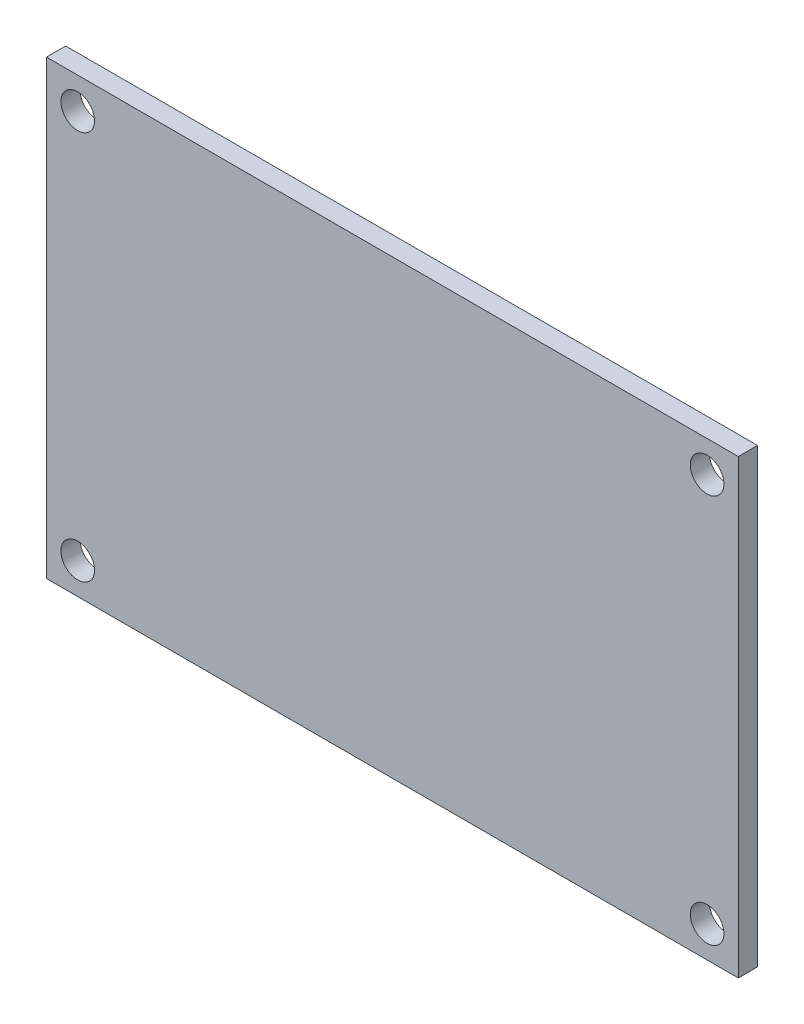
ISO-10303-21;
HEADER;
FILE_DESCRIPTION(('STEP AP214'),'2;1');
FILE_NAME('part.step','',(''),(''),'','','');
FILE_SCHEMA(('AUTOMOTIVE_DESIGN { 1 0 10303 214 1 1 1 1 }'));
ENDSEC;
DATA;
#1=APPLICATION_CONTEXT('core data for automotive mechanical design processes');
#2=APPLICATION_PROTOCOL_DEFINITION('international standard','automotive_design',2000,#1);
#3=PRODUCT_CONTEXT('',#1,'mechanical');
#4=PRODUCT('Part','Part','',(#3));
#5=PRODUCT_RELATED_PRODUCT_CATEGORY('part','',(#4));
#6=PRODUCT_DEFINITION_FORMATION('','',#4);
#7=PRODUCT_DEFINITION_CONTEXT('part definition',#1,'design');
#8=PRODUCT_DEFINITION('design','',#6,#7);
#9=PRODUCT_DEFINITION_SHAPE('','',#8);
#10=(LENGTH_UNIT() NAMED_UNIT(*) SI_UNIT(.MILLI.,.METRE.));
#11=(NAMED_UNIT(*) PLANE_ANGLE_UNIT() SI_UNIT($,.RADIAN.));
#12=(NAMED_UNIT(*) SI_UNIT($,.STERADIAN.) SOLID_ANGLE_UNIT());
#13=UNCERTAINTY_MEASURE_WITH_UNIT(LENGTH_MEASURE(1.E-05),#10,'distance_accuracy_value','');
#14=(GEOMETRIC_REPRESENTATION_CONTEXT(3) GLOBAL_UNCERTAINTY_ASSIGNED_CONTEXT((#13)) GLOBAL_UNIT_ASSIGNED_CONTEXT((#10,
#11,#12)) REPRESENTATION_CONTEXT('',''));
#15=CARTESIAN_POINT('',(0.,0.,0.));
#16=DIRECTION('',(0.,0.,1.));
#17=DIRECTION('',(1.,0.,0.));
#18=AXIS2_PLACEMENT_3D('',#15,#16,#17);
#19=CARTESIAN_POINT('',(36.,-23.5,2.));
#20=DIRECTION('',(-1.,0.,0.));
#21=DIRECTION('',(0.,0.,1.));
#22=AXIS2_PLACEMENT_3D('',#19,#20,#21);
#23=PLANE('',#22);
#24=DIRECTION('',(0.,1.,0.));
#25=VECTOR('',#24,1.);
#26=CARTESIAN_POINT('',(36.,-23.5,0.));
#27=LINE('',#26,#25);
#28=CARTESIAN_POINT('',(36.,-23.5,0.));
#29=VERTEX_POINT('',#28);
#30=CARTESIAN_POINT('',(36.,23.5,0.));
#31=VERTEX_POINT('',#30);
#32=EDGE_CURVE('E110',#29,#31,#27,.T.);
#33=ORIENTED_EDGE('',*,*,#32,.T.);
#34=DIRECTION('',(0.,0.,-1.));
#35=VECTOR('',#34,1.);
#36=CARTESIAN_POINT('',(36.,23.5,2.));
#37=LINE('',#36,#35);
#38=CARTESIAN_POINT('',(36.,23.5,2.));
#39=VERTEX_POINT('',#38);
#40=EDGE_CURVE('E11',#39,#31,#37,.T.);
#41=ORIENTED_EDGE('',*,*,#40,.F.);
#42=DIRECTION('',(0.,1.,0.));
#43=VECTOR('',#42,1.);
#44=CARTESIAN_POINT('',(36.,-23.5,2.));
#45=LINE('',#44,#43);
#46=CARTESIAN_POINT('',(36.,-23.5,2.));
#47=VERTEX_POINT('',#46);
#48=EDGE_CURVE('E93',#47,#39,#45,.T.);
#49=ORIENTED_EDGE('',*,*,#48,.F.);
#50=DIRECTION('',(0.,0.,-1.));
#51=VECTOR('',#50,1.);
#52=CARTESIAN_POINT('',(36.,-23.5,2.));
#53=LINE('',#52,#51);
#54=EDGE_CURVE('E106',#47,#29,#53,.T.);
#55=ORIENTED_EDGE('',*,*,#54,.T.);
#56=EDGE_LOOP('',(#33,#41,#49,#55));
#57=FACE_BOUND('',#56,.T.);
#58=ADVANCED_FACE('F39',(#57),#23,.F.);
#59=CARTESIAN_POINT('',(-36.,23.5,2.));
#60=DIRECTION('',(0.,-1.,0.));
#61=DIRECTION('',(0.,0.,-1.));
#62=AXIS2_PLACEMENT_3D('',#59,#60,#61);
#63=PLANE('',#62);
#64=DIRECTION('',(-1.,0.,0.));
#65=VECTOR('',#64,1.);
#66=CARTESIAN_POINT('',(-36.,23.5,0.));
#67=LINE('',#66,#65);
#68=CARTESIAN_POINT('',(-36.,23.5,0.));
#69=VERTEX_POINT('',#68);
#70=EDGE_CURVE('E98',#31,#69,#67,.T.);
#71=ORIENTED_EDGE('',*,*,#70,.T.);
#72=DIRECTION('',(0.,0.,-1.));
#73=VECTOR('',#72,1.);
#74=CARTESIAN_POINT('',(-36.,23.5,2.));
#75=LINE('',#74,#73);
#76=CARTESIAN_POINT('',(-36.,23.5,2.));
#77=VERTEX_POINT('',#76);
#78=EDGE_CURVE('E49',#77,#69,#75,.T.);
#79=ORIENTED_EDGE('',*,*,#78,.F.);
#80=DIRECTION('',(-1.,0.,0.));
#81=VECTOR('',#80,1.);
#82=CARTESIAN_POINT('',(-36.,23.5,2.));
#83=LINE('',#82,#81);
#84=EDGE_CURVE('E88',#39,#77,#83,.T.);
#85=ORIENTED_EDGE('',*,*,#84,.F.);
#86=ORIENTED_EDGE('',*,*,#40,.T.);
#87=EDGE_LOOP('',(#71,#79,#85,#86));
#88=FACE_BOUND('',#87,.T.);
#89=ADVANCED_FACE('F97',(#88),#63,.F.);
#90=CARTESIAN_POINT('',(-36.,-23.5,2.));
#91=DIRECTION('',(1.,0.,0.));
#92=DIRECTION('',(0.,0.,-1.));
#93=AXIS2_PLACEMENT_3D('',#90,#91,#92);
#94=PLANE('',#93);
#95=DIRECTION('',(0.,-1.,0.));
#96=VECTOR('',#95,1.);
#97=CARTESIAN_POINT('',(-36.,-23.5,0.));
#98=LINE('',#97,#96);
#99=CARTESIAN_POINT('',(-36.,-23.5,0.));
#100=VERTEX_POINT('',#99);
#101=EDGE_CURVE('E75',#69,#100,#98,.T.);
#102=ORIENTED_EDGE('',*,*,#101,.T.);
#103=DIRECTION('',(0.,0.,-1.));
#104=VECTOR('',#103,1.);
#105=CARTESIAN_POINT('',(-36.,-23.5,2.));
#106=LINE('',#105,#104);
#107=CARTESIAN_POINT('',(-36.,-23.5,2.));
#108=VERTEX_POINT('',#107);
#109=EDGE_CURVE('E100',#108,#100,#106,.T.);
#110=ORIENTED_EDGE('',*,*,#109,.F.);
#111=DIRECTION('',(0.,-1.,0.));
#112=VECTOR('',#111,1.);
#113=CARTESIAN_POINT('',(-36.,-23.5,2.));
#114=LINE('',#113,#112);
#115=EDGE_CURVE('E91',#77,#108,#114,.T.);
#116=ORIENTED_EDGE('',*,*,#115,.F.);
#117=ORIENTED_EDGE('',*,*,#78,.T.);
#118=EDGE_LOOP('',(#102,#110,#116,#117));
#119=FACE_BOUND('',#118,.T.);
#120=ADVANCED_FACE('F102',(#119),#94,.F.);
#121=CARTESIAN_POINT('',(-36.,-23.5,2.));
#122=DIRECTION('',(0.,1.,0.));
#123=DIRECTION('',(0.,0.,1.));
#124=AXIS2_PLACEMENT_3D('',#121,#122,#123);
#125=PLANE('',#124);
#126=DIRECTION('',(1.,0.,0.));
#127=VECTOR('',#126,1.);
#128=CARTESIAN_POINT('',(-36.,-23.5,0.));
#129=LINE('',#128,#127);
#130=EDGE_CURVE('E81',#100,#29,#129,.T.);
#131=ORIENTED_EDGE('',*,*,#130,.T.);
#132=ORIENTED_EDGE('',*,*,#54,.F.);
#133=DIRECTION('',(1.,0.,0.));
#134=VECTOR('',#133,1.);
#135=CARTESIAN_POINT('',(-36.,-23.5,2.));
#136=LINE('',#135,#134);
#137=EDGE_CURVE('E58',#108,#47,#136,.T.);
#138=ORIENTED_EDGE('',*,*,#137,.F.);
#139=ORIENTED_EDGE('',*,*,#109,.T.);
#140=EDGE_LOOP('',(#131,#132,#138,#139));
#141=FACE_BOUND('',#140,.T.);
#142=ADVANCED_FACE('F174',(#141),#125,.F.);
#143=CARTESIAN_POINT('',(0.,0.,2.));
#144=DIRECTION('',(0.,0.,-1.));
#145=DIRECTION('',(-1.,0.,0.));
#146=AXIS2_PLACEMENT_3D('',#143,#144,#145);
#147=PLANE('',#146);
#148=CARTESIAN_POINT('',(-32.75,-20.25,2.));
#149=DIRECTION('',(0.,0.,1.));
#150=DIRECTION('',(1.,0.,0.));
#151=AXIS2_PLACEMENT_3D('',#148,#149,#150);
#152=CIRCLE('',#151,1.75);
#153=CARTESIAN_POINT('',(-31.,-20.25,2.));
#154=VERTEX_POINT('',#153);
#155=EDGE_CURVE('E150',#154,#154,#152,.T.);
#156=ORIENTED_EDGE('',*,*,#155,.F.);
#157=EDGE_LOOP('',(#156));
#158=FACE_BOUND('',#157,.T.);
#159=CARTESIAN_POINT('',(32.75,-20.25,2.));
#160=DIRECTION('',(0.,0.,1.));
#161=DIRECTION('',(1.,0.,0.));
#162=AXIS2_PLACEMENT_3D('',#159,#160,#161);
#163=CIRCLE('',#162,1.75);
#164=CARTESIAN_POINT('',(34.5,-20.25,2.));
#165=VERTEX_POINT('',#164);
#166=EDGE_CURVE('E153',#165,#165,#163,.T.);
#167=ORIENTED_EDGE('',*,*,#166,.F.);
#168=EDGE_LOOP('',(#167));
#169=FACE_BOUND('',#168,.T.);
#170=CARTESIAN_POINT('',(32.75,20.25,2.));
#171=DIRECTION('',(0.,0.,1.));
#172=DIRECTION('',(1.,0.,0.));
#173=AXIS2_PLACEMENT_3D('',#170,#171,#172);
#174=CIRCLE('',#173,1.75);
#175=CARTESIAN_POINT('',(34.5,20.25,2.));
#176=VERTEX_POINT('',#175);
#177=EDGE_CURVE('E157',#176,#176,#174,.T.);
#178=ORIENTED_EDGE('',*,*,#177,.F.);
#179=EDGE_LOOP('',(#178));
#180=FACE_BOUND('',#179,.T.);
#181=CARTESIAN_POINT('',(-32.75,20.25,2.));
#182=DIRECTION('',(0.,0.,1.));
#183=DIRECTION('',(1.,0.,0.));
#184=AXIS2_PLACEMENT_3D('',#181,#182,#183);
#185=CIRCLE('',#184,1.75);
#186=CARTESIAN_POINT('',(-31.,20.25,2.));
#187=VERTEX_POINT('',#186);
#188=EDGE_CURVE('E129',#187,#187,#185,.T.);
#189=ORIENTED_EDGE('',*,*,#188,.F.);
#190=EDGE_LOOP('',(#189));
#191=FACE_BOUND('',#190,.T.);
#192=ORIENTED_EDGE('',*,*,#48,.T.);
#193=ORIENTED_EDGE('',*,*,#84,.T.);
#194=ORIENTED_EDGE('',*,*,#115,.T.);
#195=ORIENTED_EDGE('',*,*,#137,.T.);
#196=EDGE_LOOP('',(#192,#193,#194,#195));
#197=FACE_BOUND('',#196,.T.);
#198=ADVANCED_FACE('F89',(#158,#169,#180,#191,#197),#147,.F.);
#199=CARTESIAN_POINT('',(0.,0.,0.));
#200=DIRECTION('',(0.,0.,-1.));
#201=DIRECTION('',(-1.,0.,0.));
#202=AXIS2_PLACEMENT_3D('',#199,#200,#201);
#203=PLANE('',#202);
#204=CARTESIAN_POINT('',(-32.75,-20.25,0.));
#205=DIRECTION('',(0.,0.,-1.));
#206=DIRECTION('',(-1.,0.,0.));
#207=AXIS2_PLACEMENT_3D('',#204,#205,#206);
#208=CIRCLE('',#207,1.75);
#209=CARTESIAN_POINT('',(-34.5,-20.25,0.));
#210=VERTEX_POINT('',#209);
#211=EDGE_CURVE('E42',#210,#210,#208,.F.);
#212=ORIENTED_EDGE('',*,*,#211,.T.);
#213=EDGE_LOOP('',(#212));
#214=FACE_BOUND('',#213,.T.);
#215=CARTESIAN_POINT('',(32.75,-20.25,0.));
#216=DIRECTION('',(0.,0.,-1.));
#217=DIRECTION('',(-1.,0.,0.));
#218=AXIS2_PLACEMENT_3D('',#215,#216,#217);
#219=CIRCLE('',#218,1.75);
#220=CARTESIAN_POINT('',(31.,-20.25,0.));
#221=VERTEX_POINT('',#220);
#222=EDGE_CURVE('E132',#221,#221,#219,.F.);
#223=ORIENTED_EDGE('',*,*,#222,.T.);
#224=EDGE_LOOP('',(#223));
#225=FACE_BOUND('',#224,.T.);
#226=CARTESIAN_POINT('',(32.75,20.25,0.));
#227=DIRECTION('',(0.,0.,-1.));
#228=DIRECTION('',(-1.,0.,0.));
#229=AXIS2_PLACEMENT_3D('',#226,#227,#228);
#230=CIRCLE('',#229,1.75);
#231=CARTESIAN_POINT('',(31.,20.25,0.));
#232=VERTEX_POINT('',#231);
#233=EDGE_CURVE('E128',#232,#232,#230,.F.);
#234=ORIENTED_EDGE('',*,*,#233,.T.);
#235=EDGE_LOOP('',(#234));
#236=FACE_BOUND('',#235,.T.);
#237=CARTESIAN_POINT('',(-32.75,20.25,0.));
#238=DIRECTION('',(0.,0.,-1.));
#239=DIRECTION('',(-1.,0.,0.));
#240=AXIS2_PLACEMENT_3D('',#237,#238,#239);
#241=CIRCLE('',#240,1.75);
#242=CARTESIAN_POINT('',(-34.5,20.25,0.));
#243=VERTEX_POINT('',#242);
#244=EDGE_CURVE('E124',#243,#243,#241,.F.);
#245=ORIENTED_EDGE('',*,*,#244,.T.);
#246=EDGE_LOOP('',(#245));
#247=FACE_BOUND('',#246,.T.);
#248=ORIENTED_EDGE('',*,*,#32,.F.);
#249=ORIENTED_EDGE('',*,*,#130,.F.);
#250=ORIENTED_EDGE('',*,*,#101,.F.);
#251=ORIENTED_EDGE('',*,*,#70,.F.);
#252=EDGE_LOOP('',(#248,#249,#250,#251));
#253=FACE_BOUND('',#252,.T.);
#254=ADVANCED_FACE('F141',(#214,#225,#236,#247,#253),#203,.T.);
#255=CARTESIAN_POINT('',(-32.75,20.25,2.));
#256=DIRECTION('',(0.,0.,-1.));
#257=DIRECTION('',(-1.,0.,0.));
#258=AXIS2_PLACEMENT_3D('',#255,#256,#257);
#259=CYLINDRICAL_SURFACE('',#258,1.75);
#260=ORIENTED_EDGE('',*,*,#244,.F.);
#261=EDGE_LOOP('',(#260));
#262=FACE_BOUND('',#261,.T.);
#263=ORIENTED_EDGE('',*,*,#188,.T.);
#264=EDGE_LOOP('',(#263));
#265=FACE_BOUND('',#264,.T.);
#266=ADVANCED_FACE('F180',(#262,#265),#259,.F.);
#267=CARTESIAN_POINT('',(32.75,20.25,2.));
#268=DIRECTION('',(0.,0.,-1.));
#269=DIRECTION('',(-1.,0.,0.));
#270=AXIS2_PLACEMENT_3D('',#267,#268,#269);
#271=CYLINDRICAL_SURFACE('',#270,1.75);
#272=ORIENTED_EDGE('',*,*,#233,.F.);
#273=EDGE_LOOP('',(#272));
#274=FACE_BOUND('',#273,.T.);
#275=ORIENTED_EDGE('',*,*,#177,.T.);
#276=EDGE_LOOP('',(#275));
#277=FACE_BOUND('',#276,.T.);
#278=ADVANCED_FACE('F170',(#274,#277),#271,.F.);
#279=CARTESIAN_POINT('',(32.75,-20.25,2.));
#280=DIRECTION('',(0.,0.,-1.));
#281=DIRECTION('',(-1.,0.,0.));
#282=AXIS2_PLACEMENT_3D('',#279,#280,#281);
#283=CYLINDRICAL_SURFACE('',#282,1.75);
#284=ORIENTED_EDGE('',*,*,#222,.F.);
#285=EDGE_LOOP('',(#284));
#286=FACE_BOUND('',#285,.T.);
#287=ORIENTED_EDGE('',*,*,#166,.T.);
#288=EDGE_LOOP('',(#287));
#289=FACE_BOUND('',#288,.T.);
#290=ADVANCED_FACE('F146',(#286,#289),#283,.F.);
#291=CARTESIAN_POINT('',(-32.75,-20.25,2.));
#292=DIRECTION('',(0.,0.,-1.));
#293=DIRECTION('',(-1.,0.,0.));
#294=AXIS2_PLACEMENT_3D('',#291,#292,#293);
#295=CYLINDRICAL_SURFACE('',#294,1.75);
#296=ORIENTED_EDGE('',*,*,#211,.F.);
#297=EDGE_LOOP('',(#296));
#298=FACE_BOUND('',#297,.T.);
#299=ORIENTED_EDGE('',*,*,#155,.T.);
#300=EDGE_LOOP('',(#299));
#301=FACE_BOUND('',#300,.T.);
#302=ADVANCED_FACE('F143',(#298,#301),#295,.F.);
#303=CLOSED_SHELL('',(#58,#89,#120,#142,#198,#254,#266,#278,#290,#302));
#304=MANIFOLD_SOLID_BREP('B2',#303);
#305=ADVANCED_BREP_SHAPE_REPRESENTATION('',(#18,#304),#14);
#306=SHAPE_DEFINITION_REPRESENTATION(#9,#305);
ENDSEC;
END-ISO-10303-21;
